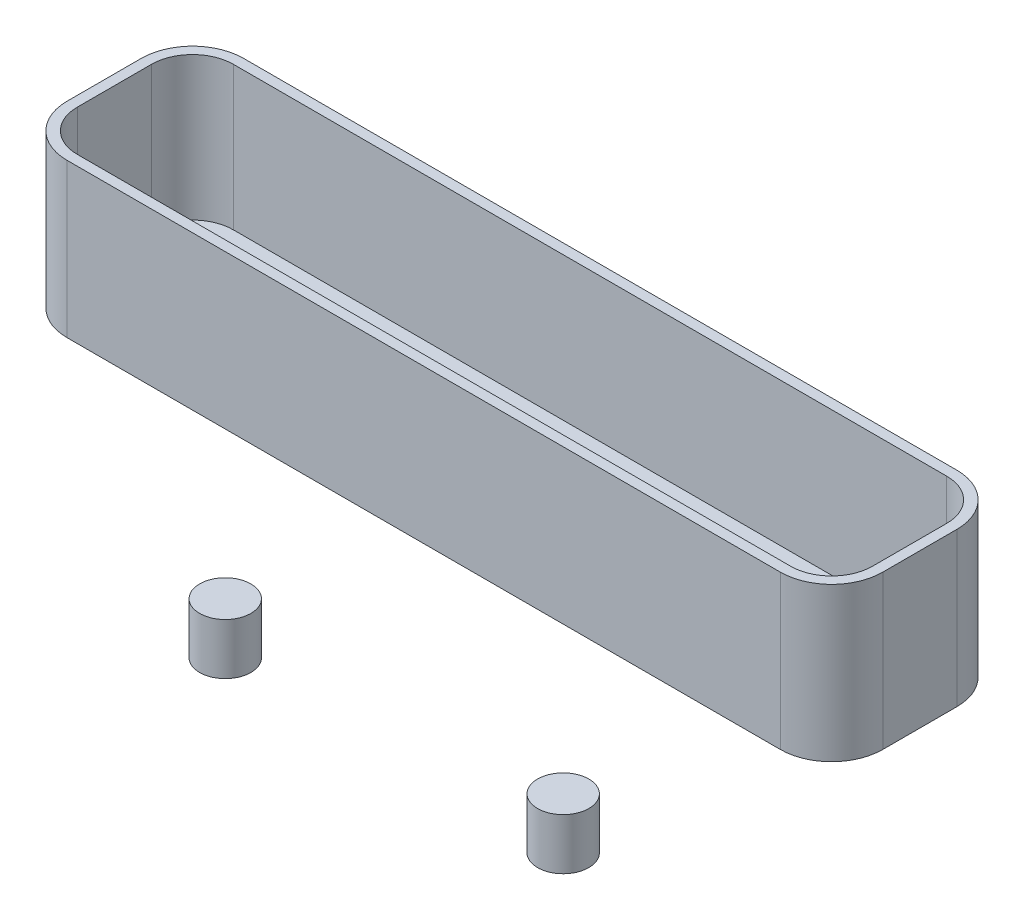
ISO-10303-21;
HEADER;
FILE_DESCRIPTION(('STEP AP214'),'2;1');
FILE_NAME('part.step','',(''),(''),'','','');
FILE_SCHEMA(('AUTOMOTIVE_DESIGN { 1 0 10303 214 1 1 1 1 }'));
ENDSEC;
DATA;
#1=APPLICATION_CONTEXT('core data for automotive mechanical design processes');
#2=APPLICATION_PROTOCOL_DEFINITION('international standard','automotive_design',2000,#1);
#3=PRODUCT_CONTEXT('',#1,'mechanical');
#4=PRODUCT('Part','Part','',(#3));
#5=PRODUCT_RELATED_PRODUCT_CATEGORY('part','',(#4));
#6=PRODUCT_DEFINITION_FORMATION('','',#4);
#7=PRODUCT_DEFINITION_CONTEXT('part definition',#1,'design');
#8=PRODUCT_DEFINITION('design','',#6,#7);
#9=PRODUCT_DEFINITION_SHAPE('','',#8);
#10=(LENGTH_UNIT() NAMED_UNIT(*) SI_UNIT(.MILLI.,.METRE.));
#11=(NAMED_UNIT(*) PLANE_ANGLE_UNIT() SI_UNIT($,.RADIAN.));
#12=(NAMED_UNIT(*) SI_UNIT($,.STERADIAN.) SOLID_ANGLE_UNIT());
#13=UNCERTAINTY_MEASURE_WITH_UNIT(LENGTH_MEASURE(1.E-05),#10,'distance_accuracy_value','');
#14=(GEOMETRIC_REPRESENTATION_CONTEXT(3) GLOBAL_UNCERTAINTY_ASSIGNED_CONTEXT((#13)) GLOBAL_UNIT_ASSIGNED_CONTEXT((#10,
#11,#12)) REPRESENTATION_CONTEXT('',''));
#15=CARTESIAN_POINT('',(0.,0.,0.));
#16=DIRECTION('',(0.,0.,1.));
#17=DIRECTION('',(1.,0.,0.));
#18=AXIS2_PLACEMENT_3D('',#15,#16,#17);
#19=CARTESIAN_POINT('',(79.6511661041203,52.9291308994879,-17.2408657024059));
#20=DIRECTION('',(-1.,0.,0.));
#21=DIRECTION('',(0.,0.,1.));
#22=AXIS2_PLACEMENT_3D('',#19,#20,#21);
#23=PLANE('',#22);
#24=DIRECTION('',(0.,0.,-1.));
#25=VECTOR('',#24,1.);
#26=CARTESIAN_POINT('',(79.6511661041203,52.9291308994879,-17.2408657024059));
#27=LINE('',#26,#25);
#28=CARTESIAN_POINT('',(79.6511661041203,52.9291308994879,7.24086570240593));
#29=VERTEX_POINT('',#28);
#30=CARTESIAN_POINT('',(79.6511661041203,52.9291308994879,-7.24086570240593));
#31=VERTEX_POINT('',#30);
#32=EDGE_CURVE('E211',#29,#31,#27,.T.);
#33=ORIENTED_EDGE('',*,*,#32,.F.);
#34=DIRECTION('',(0.,-1.,0.));
#35=VECTOR('',#34,1.);
#36=CARTESIAN_POINT('',(79.6511661041203,52.9291308994879,7.24086570240593));
#37=LINE('',#36,#35);
#38=CARTESIAN_POINT('',(79.6511661041203,22.9291308994879,7.24086570240593));
#39=VERTEX_POINT('',#38);
#40=EDGE_CURVE('E12',#29,#39,#37,.T.);
#41=ORIENTED_EDGE('',*,*,#40,.T.);
#42=DIRECTION('',(0.,0.,-1.));
#43=VECTOR('',#42,1.);
#44=CARTESIAN_POINT('',(79.6511661041203,22.9291308994879,-17.2408657024059));
#45=LINE('',#44,#43);
#46=CARTESIAN_POINT('',(79.6511661041203,22.9291308994879,-7.24086570240593));
#47=VERTEX_POINT('',#46);
#48=EDGE_CURVE('E224',#39,#47,#45,.T.);
#49=ORIENTED_EDGE('',*,*,#48,.T.);
#50=DIRECTION('',(0.,-1.,0.));
#51=VECTOR('',#50,1.);
#52=CARTESIAN_POINT('',(79.6511661041203,52.9291308994879,-7.24086570240593));
#53=LINE('',#52,#51);
#54=EDGE_CURVE('E50',#47,#31,#53,.F.);
#55=ORIENTED_EDGE('',*,*,#54,.T.);
#56=EDGE_LOOP('',(#33,#41,#49,#55));
#57=FACE_BOUND('',#56,.T.);
#58=ADVANCED_FACE('F42',(#57),#23,.F.);
#59=CARTESIAN_POINT('',(-79.6511661041203,52.9291308994879,-17.2408657024059));
#60=DIRECTION('',(0.,0.,1.));
#61=DIRECTION('',(1.,0.,0.));
#62=AXIS2_PLACEMENT_3D('',#59,#60,#61);
#63=PLANE('',#62);
#64=DIRECTION('',(-1.,0.,0.));
#65=VECTOR('',#64,1.);
#66=CARTESIAN_POINT('',(-79.6511661041203,22.9291308994879,-17.2408657024059));
#67=LINE('',#66,#65);
#68=CARTESIAN_POINT('',(69.6511661041203,22.9291308994879,-17.2408657024059));
#69=VERTEX_POINT('',#68);
#70=CARTESIAN_POINT('',(-69.6511661041203,22.9291308994879,-17.2408657024059));
#71=VERTEX_POINT('',#70);
#72=EDGE_CURVE('E227',#69,#71,#67,.T.);
#73=ORIENTED_EDGE('',*,*,#72,.T.);
#74=DIRECTION('',(0.,-1.,0.));
#75=VECTOR('',#74,1.);
#76=CARTESIAN_POINT('',(-69.6511661041203,52.9291308994879,-17.2408657024059));
#77=LINE('',#76,#75);
#78=CARTESIAN_POINT('',(-69.6511661041203,52.9291308994879,-17.2408657024059));
#79=VERTEX_POINT('',#78);
#80=EDGE_CURVE('E65',#71,#79,#77,.F.);
#81=ORIENTED_EDGE('',*,*,#80,.T.);
#82=DIRECTION('',(-1.,0.,0.));
#83=VECTOR('',#82,1.);
#84=CARTESIAN_POINT('',(-79.6511661041203,52.9291308994879,-17.2408657024059));
#85=LINE('',#84,#83);
#86=CARTESIAN_POINT('',(69.6511661041203,52.9291308994879,-17.2408657024059));
#87=VERTEX_POINT('',#86);
#88=EDGE_CURVE('E214',#87,#79,#85,.T.);
#89=ORIENTED_EDGE('',*,*,#88,.F.);
#90=DIRECTION('',(0.,-1.,0.));
#91=VECTOR('',#90,1.);
#92=CARTESIAN_POINT('',(69.6511661041203,52.9291308994879,-17.2408657024059));
#93=LINE('',#92,#91);
#94=EDGE_CURVE('E260',#87,#69,#93,.T.);
#95=ORIENTED_EDGE('',*,*,#94,.T.);
#96=EDGE_LOOP('',(#73,#81,#89,#95));
#97=FACE_BOUND('',#96,.T.);
#98=ADVANCED_FACE('F275',(#97),#63,.F.);
#99=CARTESIAN_POINT('',(-79.6511661041203,52.9291308994879,-17.2408657024059));
#100=DIRECTION('',(1.,0.,0.));
#101=DIRECTION('',(0.,0.,-1.));
#102=AXIS2_PLACEMENT_3D('',#99,#100,#101);
#103=PLANE('',#102);
#104=DIRECTION('',(0.,0.,1.));
#105=VECTOR('',#104,1.);
#106=CARTESIAN_POINT('',(-79.6511661041203,22.9291308994879,-17.2408657024059));
#107=LINE('',#106,#105);
#108=CARTESIAN_POINT('',(-79.6511661041203,22.9291308994879,-7.24086570240593));
#109=VERTEX_POINT('',#108);
#110=CARTESIAN_POINT('',(-79.6511661041203,22.9291308994879,7.24086570240593));
#111=VERTEX_POINT('',#110);
#112=EDGE_CURVE('E230',#109,#111,#107,.T.);
#113=ORIENTED_EDGE('',*,*,#112,.T.);
#114=DIRECTION('',(0.,-1.,0.));
#115=VECTOR('',#114,1.);
#116=CARTESIAN_POINT('',(-79.6511661041203,52.9291308994879,7.24086570240593));
#117=LINE('',#116,#115);
#118=CARTESIAN_POINT('',(-79.6511661041203,52.9291308994879,7.24086570240593));
#119=VERTEX_POINT('',#118);
#120=EDGE_CURVE('E250',#111,#119,#117,.F.);
#121=ORIENTED_EDGE('',*,*,#120,.T.);
#122=DIRECTION('',(0.,0.,1.));
#123=VECTOR('',#122,1.);
#124=CARTESIAN_POINT('',(-79.6511661041203,52.9291308994879,-17.2408657024059));
#125=LINE('',#124,#123);
#126=CARTESIAN_POINT('',(-79.6511661041203,52.9291308994879,-7.24086570240593));
#127=VERTEX_POINT('',#126);
#128=EDGE_CURVE('E217',#127,#119,#125,.T.);
#129=ORIENTED_EDGE('',*,*,#128,.F.);
#130=DIRECTION('',(0.,-1.,0.));
#131=VECTOR('',#130,1.);
#132=CARTESIAN_POINT('',(-79.6511661041203,52.9291308994879,-7.24086570240593));
#133=LINE('',#132,#131);
#134=EDGE_CURVE('E247',#127,#109,#133,.T.);
#135=ORIENTED_EDGE('',*,*,#134,.T.);
#136=EDGE_LOOP('',(#113,#121,#129,#135));
#137=FACE_BOUND('',#136,.T.);
#138=ADVANCED_FACE('F286',(#137),#103,.F.);
#139=CARTESIAN_POINT('',(-79.6511661041203,52.9291308994879,17.2408657024059));
#140=DIRECTION('',(0.,0.,-1.));
#141=DIRECTION('',(-1.,0.,0.));
#142=AXIS2_PLACEMENT_3D('',#139,#140,#141);
#143=PLANE('',#142);
#144=DIRECTION('',(1.,0.,0.));
#145=VECTOR('',#144,1.);
#146=CARTESIAN_POINT('',(-79.6511661041203,52.9291308994879,17.2408657024059));
#147=LINE('',#146,#145);
#148=CARTESIAN_POINT('',(-69.6511661041203,52.9291308994879,17.2408657024059));
#149=VERTEX_POINT('',#148);
#150=CARTESIAN_POINT('',(69.6511661041203,52.9291308994879,17.2408657024059));
#151=VERTEX_POINT('',#150);
#152=EDGE_CURVE('E220',#149,#151,#147,.T.);
#153=ORIENTED_EDGE('',*,*,#152,.F.);
#154=DIRECTION('',(0.,-1.,0.));
#155=VECTOR('',#154,1.);
#156=CARTESIAN_POINT('',(-69.6511661041203,52.9291308994879,17.2408657024059));
#157=LINE('',#156,#155);
#158=CARTESIAN_POINT('',(-69.6511661041203,22.9291308994879,17.2408657024059));
#159=VERTEX_POINT('',#158);
#160=EDGE_CURVE('E236',#149,#159,#157,.T.);
#161=ORIENTED_EDGE('',*,*,#160,.T.);
#162=DIRECTION('',(1.,0.,0.));
#163=VECTOR('',#162,1.);
#164=CARTESIAN_POINT('',(-79.6511661041203,22.9291308994879,17.2408657024059));
#165=LINE('',#164,#163);
#166=CARTESIAN_POINT('',(69.6511661041203,22.9291308994879,17.2408657024059));
#167=VERTEX_POINT('',#166);
#168=EDGE_CURVE('E215',#159,#167,#165,.T.);
#169=ORIENTED_EDGE('',*,*,#168,.T.);
#170=DIRECTION('',(0.,-1.,0.));
#171=VECTOR('',#170,1.);
#172=CARTESIAN_POINT('',(69.6511661041203,52.9291308994879,17.2408657024059));
#173=LINE('',#172,#171);
#174=EDGE_CURVE('E223',#167,#151,#173,.F.);
#175=ORIENTED_EDGE('',*,*,#174,.T.);
#176=EDGE_LOOP('',(#153,#161,#169,#175));
#177=FACE_BOUND('',#176,.T.);
#178=ADVANCED_FACE('F294',(#177),#143,.F.);
#179=CARTESIAN_POINT('',(0.,52.9291308994879,0.));
#180=DIRECTION('',(0.,1.,0.));
#181=DIRECTION('',(0.,0.,1.));
#182=AXIS2_PLACEMENT_3D('',#179,#180,#181);
#183=PLANE('',#182);
#184=DIRECTION('',(0.,0.,1.));
#185=VECTOR('',#184,1.);
#186=CARTESIAN_POINT('',(-77.6511661041203,52.9291308994879,-17.2408657024059));
#187=LINE('',#186,#185);
#188=CARTESIAN_POINT('',(-77.6511661041203,52.9291308994879,-7.24086570240593));
#189=VERTEX_POINT('',#188);
#190=CARTESIAN_POINT('',(-77.6511661041203,52.9291308994879,7.24086570240593));
#191=VERTEX_POINT('',#190);
#192=EDGE_CURVE('E184',#189,#191,#187,.T.);
#193=ORIENTED_EDGE('',*,*,#192,.F.);
#194=CARTESIAN_POINT('',(-69.6511661041203,52.9291308994879,-7.24086570240593));
#195=DIRECTION('',(0.,1.,0.));
#196=DIRECTION('',(0.,0.,1.));
#197=AXIS2_PLACEMENT_3D('',#194,#195,#196);
#198=CIRCLE('',#197,8.);
#199=CARTESIAN_POINT('',(-69.6511661041203,52.9291308994879,-15.2408657024059));
#200=VERTEX_POINT('',#199);
#201=EDGE_CURVE('E202',#200,#189,#198,.T.);
#202=ORIENTED_EDGE('',*,*,#201,.F.);
#203=DIRECTION('',(-1.,0.,0.));
#204=VECTOR('',#203,1.);
#205=CARTESIAN_POINT('',(-79.6511661041203,52.9291308994879,-15.2408657024059));
#206=LINE('',#205,#204);
#207=CARTESIAN_POINT('',(69.6511661041203,52.9291308994879,-15.2408657024059));
#208=VERTEX_POINT('',#207);
#209=EDGE_CURVE('E57',#208,#200,#206,.T.);
#210=ORIENTED_EDGE('',*,*,#209,.F.);
#211=CARTESIAN_POINT('',(69.6511661041203,52.9291308994879,-7.24086570240593));
#212=DIRECTION('',(0.,1.,0.));
#213=DIRECTION('',(0.,0.,1.));
#214=AXIS2_PLACEMENT_3D('',#211,#212,#213);
#215=CIRCLE('',#214,8.);
#216=CARTESIAN_POINT('',(77.6511661041203,52.9291308994879,-7.24086570240593));
#217=VERTEX_POINT('',#216);
#218=EDGE_CURVE('E186',#217,#208,#215,.T.);
#219=ORIENTED_EDGE('',*,*,#218,.F.);
#220=DIRECTION('',(0.,0.,-1.));
#221=VECTOR('',#220,1.);
#222=CARTESIAN_POINT('',(77.6511661041203,52.9291308994879,-17.2408657024059));
#223=LINE('',#222,#221);
#224=CARTESIAN_POINT('',(77.6511661041203,52.9291308994879,7.24086570240593));
#225=VERTEX_POINT('',#224);
#226=EDGE_CURVE('E198',#225,#217,#223,.T.);
#227=ORIENTED_EDGE('',*,*,#226,.F.);
#228=CARTESIAN_POINT('',(69.6511661041203,52.9291308994879,7.24086570240593));
#229=DIRECTION('',(0.,1.,0.));
#230=DIRECTION('',(0.,0.,1.));
#231=AXIS2_PLACEMENT_3D('',#228,#229,#230);
#232=CIRCLE('',#231,8.);
#233=CARTESIAN_POINT('',(69.6511661041203,52.9291308994879,15.2408657024059));
#234=VERTEX_POINT('',#233);
#235=EDGE_CURVE('E188',#234,#225,#232,.T.);
#236=ORIENTED_EDGE('',*,*,#235,.F.);
#237=DIRECTION('',(1.,0.,0.));
#238=VECTOR('',#237,1.);
#239=CARTESIAN_POINT('',(-79.6511661041203,52.9291308994879,15.2408657024059));
#240=LINE('',#239,#238);
#241=CARTESIAN_POINT('',(-69.6511661041203,52.9291308994879,15.2408657024059));
#242=VERTEX_POINT('',#241);
#243=EDGE_CURVE('E197',#242,#234,#240,.T.);
#244=ORIENTED_EDGE('',*,*,#243,.F.);
#245=CARTESIAN_POINT('',(-69.6511661041203,52.9291308994879,7.24086570240593));
#246=DIRECTION('',(0.,1.,0.));
#247=DIRECTION('',(0.,0.,1.));
#248=AXIS2_PLACEMENT_3D('',#245,#246,#247);
#249=CIRCLE('',#248,8.);
#250=EDGE_CURVE('E204',#191,#242,#249,.T.);
#251=ORIENTED_EDGE('',*,*,#250,.F.);
#252=EDGE_LOOP('',(#193,#202,#210,#219,#227,#236,#244,#251));
#253=FACE_BOUND('',#252,.T.);
#254=ORIENTED_EDGE('',*,*,#128,.T.);
#255=CARTESIAN_POINT('',(-69.6511661041203,52.9291308994879,7.24086570240593));
#256=DIRECTION('',(0.,1.,0.));
#257=DIRECTION('',(0.,0.,1.));
#258=AXIS2_PLACEMENT_3D('',#255,#256,#257);
#259=CIRCLE('',#258,10.);
#260=EDGE_CURVE('E258',#119,#149,#259,.T.);
#261=ORIENTED_EDGE('',*,*,#260,.T.);
#262=ORIENTED_EDGE('',*,*,#152,.T.);
#263=CARTESIAN_POINT('',(69.6511661041203,52.9291308994879,7.24086570240593));
#264=DIRECTION('',(0.,1.,0.));
#265=DIRECTION('',(0.,0.,1.));
#266=AXIS2_PLACEMENT_3D('',#263,#264,#265);
#267=CIRCLE('',#266,10.);
#268=EDGE_CURVE('E254',#151,#29,#267,.T.);
#269=ORIENTED_EDGE('',*,*,#268,.T.);
#270=ORIENTED_EDGE('',*,*,#32,.T.);
#271=CARTESIAN_POINT('',(69.6511661041203,52.9291308994879,-7.24086570240593));
#272=DIRECTION('',(0.,1.,0.));
#273=DIRECTION('',(0.,0.,1.));
#274=AXIS2_PLACEMENT_3D('',#271,#272,#273);
#275=CIRCLE('',#274,10.);
#276=EDGE_CURVE('E252',#31,#87,#275,.T.);
#277=ORIENTED_EDGE('',*,*,#276,.T.);
#278=ORIENTED_EDGE('',*,*,#88,.T.);
#279=CARTESIAN_POINT('',(-69.6511661041203,52.9291308994879,-7.24086570240593));
#280=DIRECTION('',(0.,1.,0.));
#281=DIRECTION('',(0.,0.,1.));
#282=AXIS2_PLACEMENT_3D('',#279,#280,#281);
#283=CIRCLE('',#282,10.);
#284=EDGE_CURVE('E256',#79,#127,#283,.T.);
#285=ORIENTED_EDGE('',*,*,#284,.T.);
#286=EDGE_LOOP('',(#254,#261,#262,#269,#270,#277,#278,#285));
#287=FACE_BOUND('',#286,.T.);
#288=ADVANCED_FACE('F271',(#253,#287),#183,.T.);
#289=CARTESIAN_POINT('',(0.,22.9291308994879,0.));
#290=DIRECTION('',(0.,1.,0.));
#291=DIRECTION('',(0.,0.,1.));
#292=AXIS2_PLACEMENT_3D('',#289,#290,#291);
#293=PLANE('',#292);
#294=ORIENTED_EDGE('',*,*,#168,.F.);
#295=CARTESIAN_POINT('',(-69.6511661041203,22.9291308994879,7.24086570240593));
#296=DIRECTION('',(0.,1.,0.));
#297=DIRECTION('',(0.,0.,1.));
#298=AXIS2_PLACEMENT_3D('',#295,#296,#297);
#299=CIRCLE('',#298,10.);
#300=EDGE_CURVE('E245',#159,#111,#299,.F.);
#301=ORIENTED_EDGE('',*,*,#300,.T.);
#302=ORIENTED_EDGE('',*,*,#112,.F.);
#303=CARTESIAN_POINT('',(-69.6511661041203,22.9291308994879,-7.24086570240593));
#304=DIRECTION('',(0.,1.,0.));
#305=DIRECTION('',(0.,0.,1.));
#306=AXIS2_PLACEMENT_3D('',#303,#304,#305);
#307=CIRCLE('',#306,10.);
#308=EDGE_CURVE('E243',#109,#71,#307,.F.);
#309=ORIENTED_EDGE('',*,*,#308,.T.);
#310=ORIENTED_EDGE('',*,*,#72,.F.);
#311=CARTESIAN_POINT('',(69.6511661041203,22.9291308994879,-7.24086570240593));
#312=DIRECTION('',(0.,1.,0.));
#313=DIRECTION('',(0.,0.,1.));
#314=AXIS2_PLACEMENT_3D('',#311,#312,#313);
#315=CIRCLE('',#314,10.);
#316=EDGE_CURVE('E239',#69,#47,#315,.F.);
#317=ORIENTED_EDGE('',*,*,#316,.T.);
#318=ORIENTED_EDGE('',*,*,#48,.F.);
#319=CARTESIAN_POINT('',(69.6511661041203,22.9291308994879,7.24086570240593));
#320=DIRECTION('',(0.,1.,0.));
#321=DIRECTION('',(0.,0.,1.));
#322=AXIS2_PLACEMENT_3D('',#319,#320,#321);
#323=CIRCLE('',#322,10.);
#324=EDGE_CURVE('E241',#39,#167,#323,.F.);
#325=ORIENTED_EDGE('',*,*,#324,.T.);
#326=EDGE_LOOP('',(#294,#301,#302,#309,#310,#317,#318,#325));
#327=FACE_BOUND('',#326,.T.);
#328=ADVANCED_FACE('F278',(#327),#293,.F.);
#329=CARTESIAN_POINT('',(-69.6511661041203,52.9291308994879,7.24086570240593));
#330=DIRECTION('',(0.,-1.,0.));
#331=DIRECTION('',(0.,0.,-1.));
#332=AXIS2_PLACEMENT_3D('',#329,#330,#331);
#333=CYLINDRICAL_SURFACE('',#332,10.);
#334=ORIENTED_EDGE('',*,*,#260,.F.);
#335=ORIENTED_EDGE('',*,*,#120,.F.);
#336=ORIENTED_EDGE('',*,*,#300,.F.);
#337=ORIENTED_EDGE('',*,*,#160,.F.);
#338=EDGE_LOOP('',(#334,#335,#336,#337));
#339=FACE_BOUND('',#338,.T.);
#340=ADVANCED_FACE('F292',(#339),#333,.T.);
#341=CARTESIAN_POINT('',(-69.6511661041203,52.9291308994879,-7.24086570240593));
#342=DIRECTION('',(0.,-1.,0.));
#343=DIRECTION('',(0.,0.,-1.));
#344=AXIS2_PLACEMENT_3D('',#341,#342,#343);
#345=CYLINDRICAL_SURFACE('',#344,10.);
#346=ORIENTED_EDGE('',*,*,#284,.F.);
#347=ORIENTED_EDGE('',*,*,#80,.F.);
#348=ORIENTED_EDGE('',*,*,#308,.F.);
#349=ORIENTED_EDGE('',*,*,#134,.F.);
#350=EDGE_LOOP('',(#346,#347,#348,#349));
#351=FACE_BOUND('',#350,.T.);
#352=ADVANCED_FACE('F283',(#351),#345,.T.);
#353=CARTESIAN_POINT('',(69.6511661041203,52.9291308994879,7.24086570240593));
#354=DIRECTION('',(0.,-1.,0.));
#355=DIRECTION('',(0.,0.,-1.));
#356=AXIS2_PLACEMENT_3D('',#353,#354,#355);
#357=CYLINDRICAL_SURFACE('',#356,10.);
#358=ORIENTED_EDGE('',*,*,#268,.F.);
#359=ORIENTED_EDGE('',*,*,#174,.F.);
#360=ORIENTED_EDGE('',*,*,#324,.F.);
#361=ORIENTED_EDGE('',*,*,#40,.F.);
#362=EDGE_LOOP('',(#358,#359,#360,#361));
#363=FACE_BOUND('',#362,.T.);
#364=ADVANCED_FACE('F297',(#363),#357,.T.);
#365=CARTESIAN_POINT('',(69.6511661041203,52.9291308994879,-7.24086570240593));
#366=DIRECTION('',(0.,-1.,0.));
#367=DIRECTION('',(0.,0.,-1.));
#368=AXIS2_PLACEMENT_3D('',#365,#366,#367);
#369=CYLINDRICAL_SURFACE('',#368,10.);
#370=ORIENTED_EDGE('',*,*,#276,.F.);
#371=ORIENTED_EDGE('',*,*,#54,.F.);
#372=ORIENTED_EDGE('',*,*,#316,.F.);
#373=ORIENTED_EDGE('',*,*,#94,.F.);
#374=EDGE_LOOP('',(#370,#371,#372,#373));
#375=FACE_BOUND('',#374,.T.);
#376=ADVANCED_FACE('F44',(#375),#369,.T.);
#377=CARTESIAN_POINT('',(77.6511661041203,52.9291308994879,-17.2408657024059));
#378=DIRECTION('',(-1.,0.,0.));
#379=DIRECTION('',(0.,0.,1.));
#380=AXIS2_PLACEMENT_3D('',#377,#378,#379);
#381=PLANE('',#380);
#382=ORIENTED_EDGE('',*,*,#226,.T.);
#383=DIRECTION('',(0.,1.,0.));
#384=VECTOR('',#383,1.);
#385=CARTESIAN_POINT('',(77.6511661041203,52.9291308994879,-7.24086570240593));
#386=LINE('',#385,#384);
#387=CARTESIAN_POINT('',(77.6511661041203,24.9291308994879,-7.24086570240593));
#388=VERTEX_POINT('',#387);
#389=EDGE_CURVE('E432',#388,#217,#386,.T.);
#390=ORIENTED_EDGE('',*,*,#389,.F.);
#391=DIRECTION('',(0.,0.,-1.));
#392=VECTOR('',#391,1.);
#393=CARTESIAN_POINT('',(77.6511661041203,24.9291308994879,-17.2408657024059));
#394=LINE('',#393,#392);
#395=CARTESIAN_POINT('',(77.6511661041203,24.9291308994879,7.24086570240593));
#396=VERTEX_POINT('',#395);
#397=EDGE_CURVE('E443',#396,#388,#394,.T.);
#398=ORIENTED_EDGE('',*,*,#397,.F.);
#399=DIRECTION('',(0.,1.,0.));
#400=VECTOR('',#399,1.);
#401=CARTESIAN_POINT('',(77.6511661041203,52.9291308994879,7.24086570240593));
#402=LINE('',#401,#400);
#403=EDGE_CURVE('E228',#225,#396,#402,.F.);
#404=ORIENTED_EDGE('',*,*,#403,.F.);
#405=EDGE_LOOP('',(#382,#390,#398,#404));
#406=FACE_BOUND('',#405,.T.);
#407=ADVANCED_FACE('F303',(#406),#381,.T.);
#408=CARTESIAN_POINT('',(-79.6511661041203,52.9291308994879,-15.2408657024059));
#409=DIRECTION('',(0.,0.,1.));
#410=DIRECTION('',(1.,0.,0.));
#411=AXIS2_PLACEMENT_3D('',#408,#409,#410);
#412=PLANE('',#411);
#413=DIRECTION('',(-1.,0.,0.));
#414=VECTOR('',#413,1.);
#415=CARTESIAN_POINT('',(-79.6511661041203,24.9291308994879,-15.2408657024059));
#416=LINE('',#415,#414);
#417=CARTESIAN_POINT('',(69.6511661041203,24.9291308994879,-15.2408657024059));
#418=VERTEX_POINT('',#417);
#419=CARTESIAN_POINT('',(-69.6511661041203,24.9291308994879,-15.2408657024059));
#420=VERTEX_POINT('',#419);
#421=EDGE_CURVE('E180',#418,#420,#416,.T.);
#422=ORIENTED_EDGE('',*,*,#421,.F.);
#423=DIRECTION('',(0.,1.,0.));
#424=VECTOR('',#423,1.);
#425=CARTESIAN_POINT('',(69.6511661041203,52.9291308994879,-15.2408657024059));
#426=LINE('',#425,#424);
#427=EDGE_CURVE('E207',#208,#418,#426,.F.);
#428=ORIENTED_EDGE('',*,*,#427,.F.);
#429=ORIENTED_EDGE('',*,*,#209,.T.);
#430=DIRECTION('',(0.,1.,0.));
#431=VECTOR('',#430,1.);
#432=CARTESIAN_POINT('',(-69.6511661041203,52.9291308994879,-15.2408657024059));
#433=LINE('',#432,#431);
#434=EDGE_CURVE('E434',#420,#200,#433,.T.);
#435=ORIENTED_EDGE('',*,*,#434,.F.);
#436=EDGE_LOOP('',(#422,#428,#429,#435));
#437=FACE_BOUND('',#436,.T.);
#438=ADVANCED_FACE('F352',(#437),#412,.T.);
#439=CARTESIAN_POINT('',(-77.6511661041203,52.9291308994879,-17.2408657024059));
#440=DIRECTION('',(1.,0.,0.));
#441=DIRECTION('',(0.,0.,-1.));
#442=AXIS2_PLACEMENT_3D('',#439,#440,#441);
#443=PLANE('',#442);
#444=DIRECTION('',(0.,0.,1.));
#445=VECTOR('',#444,1.);
#446=CARTESIAN_POINT('',(-77.6511661041203,24.9291308994879,-17.2408657024059));
#447=LINE('',#446,#445);
#448=CARTESIAN_POINT('',(-77.6511661041203,24.9291308994879,-7.24086570240593));
#449=VERTEX_POINT('',#448);
#450=CARTESIAN_POINT('',(-77.6511661041203,24.9291308994879,7.24086570240593));
#451=VERTEX_POINT('',#450);
#452=EDGE_CURVE('E173',#449,#451,#447,.T.);
#453=ORIENTED_EDGE('',*,*,#452,.F.);
#454=DIRECTION('',(0.,1.,0.));
#455=VECTOR('',#454,1.);
#456=CARTESIAN_POINT('',(-77.6511661041203,52.9291308994879,-7.24086570240593));
#457=LINE('',#456,#455);
#458=EDGE_CURVE('E169',#189,#449,#457,.F.);
#459=ORIENTED_EDGE('',*,*,#458,.F.);
#460=ORIENTED_EDGE('',*,*,#192,.T.);
#461=DIRECTION('',(0.,1.,0.));
#462=VECTOR('',#461,1.);
#463=CARTESIAN_POINT('',(-77.6511661041203,52.9291308994879,7.24086570240593));
#464=LINE('',#463,#462);
#465=EDGE_CURVE('E162',#451,#191,#464,.T.);
#466=ORIENTED_EDGE('',*,*,#465,.F.);
#467=EDGE_LOOP('',(#453,#459,#460,#466));
#468=FACE_BOUND('',#467,.T.);
#469=ADVANCED_FACE('F182',(#468),#443,.T.);
#470=CARTESIAN_POINT('',(-79.6511661041203,52.9291308994879,15.2408657024059));
#471=DIRECTION('',(0.,0.,-1.));
#472=DIRECTION('',(-1.,0.,0.));
#473=AXIS2_PLACEMENT_3D('',#470,#471,#472);
#474=PLANE('',#473);
#475=ORIENTED_EDGE('',*,*,#243,.T.);
#476=DIRECTION('',(0.,1.,0.));
#477=VECTOR('',#476,1.);
#478=CARTESIAN_POINT('',(69.6511661041203,52.9291308994879,15.2408657024059));
#479=LINE('',#478,#477);
#480=CARTESIAN_POINT('',(69.6511661041203,24.9291308994879,15.2408657024059));
#481=VERTEX_POINT('',#480);
#482=EDGE_CURVE('E195',#481,#234,#479,.T.);
#483=ORIENTED_EDGE('',*,*,#482,.F.);
#484=DIRECTION('',(1.,0.,0.));
#485=VECTOR('',#484,1.);
#486=CARTESIAN_POINT('',(-79.6511661041203,24.9291308994879,15.2408657024059));
#487=LINE('',#486,#485);
#488=CARTESIAN_POINT('',(-69.6511661041203,24.9291308994879,15.2408657024059));
#489=VERTEX_POINT('',#488);
#490=EDGE_CURVE('E179',#489,#481,#487,.T.);
#491=ORIENTED_EDGE('',*,*,#490,.F.);
#492=DIRECTION('',(0.,1.,0.));
#493=VECTOR('',#492,1.);
#494=CARTESIAN_POINT('',(-69.6511661041203,52.9291308994879,15.2408657024059));
#495=LINE('',#494,#493);
#496=EDGE_CURVE('E165',#242,#489,#495,.F.);
#497=ORIENTED_EDGE('',*,*,#496,.F.);
#498=EDGE_LOOP('',(#475,#483,#491,#497));
#499=FACE_BOUND('',#498,.T.);
#500=ADVANCED_FACE('F370',(#499),#474,.T.);
#501=CARTESIAN_POINT('',(0.,24.9291308994879,0.));
#502=DIRECTION('',(0.,1.,0.));
#503=DIRECTION('',(0.,0.,1.));
#504=AXIS2_PLACEMENT_3D('',#501,#502,#503);
#505=PLANE('',#504);
#506=ORIENTED_EDGE('',*,*,#490,.T.);
#507=CARTESIAN_POINT('',(69.6511661041203,24.9291308994879,7.24086570240593));
#508=DIRECTION('',(0.,1.,0.));
#509=DIRECTION('',(0.,0.,1.));
#510=AXIS2_PLACEMENT_3D('',#507,#508,#509);
#511=CIRCLE('',#510,8.);
#512=EDGE_CURVE('E439',#396,#481,#511,.F.);
#513=ORIENTED_EDGE('',*,*,#512,.F.);
#514=ORIENTED_EDGE('',*,*,#397,.T.);
#515=CARTESIAN_POINT('',(69.6511661041203,24.9291308994879,-7.24086570240593));
#516=DIRECTION('',(0.,1.,0.));
#517=DIRECTION('',(0.,0.,1.));
#518=AXIS2_PLACEMENT_3D('',#515,#516,#517);
#519=CIRCLE('',#518,8.);
#520=EDGE_CURVE('E194',#418,#388,#519,.F.);
#521=ORIENTED_EDGE('',*,*,#520,.F.);
#522=ORIENTED_EDGE('',*,*,#421,.T.);
#523=CARTESIAN_POINT('',(-69.6511661041203,24.9291308994879,-7.24086570240593));
#524=DIRECTION('',(0.,1.,0.));
#525=DIRECTION('',(0.,0.,1.));
#526=AXIS2_PLACEMENT_3D('',#523,#524,#525);
#527=CIRCLE('',#526,8.);
#528=EDGE_CURVE('E170',#449,#420,#527,.F.);
#529=ORIENTED_EDGE('',*,*,#528,.F.);
#530=ORIENTED_EDGE('',*,*,#452,.T.);
#531=CARTESIAN_POINT('',(-69.6511661041203,24.9291308994879,7.24086570240593));
#532=DIRECTION('',(0.,1.,0.));
#533=DIRECTION('',(0.,0.,1.));
#534=AXIS2_PLACEMENT_3D('',#531,#532,#533);
#535=CIRCLE('',#534,8.);
#536=EDGE_CURVE('E158',#489,#451,#535,.F.);
#537=ORIENTED_EDGE('',*,*,#536,.F.);
#538=EDGE_LOOP('',(#506,#513,#514,#521,#522,#529,#530,#537));
#539=FACE_BOUND('',#538,.T.);
#540=ADVANCED_FACE('F174',(#539),#505,.T.);
#541=CARTESIAN_POINT('',(-69.6511661041203,52.9291308994879,7.24086570240593));
#542=DIRECTION('',(0.,-1.,0.));
#543=DIRECTION('',(0.,0.,-1.));
#544=AXIS2_PLACEMENT_3D('',#541,#542,#543);
#545=CYLINDRICAL_SURFACE('',#544,8.);
#546=ORIENTED_EDGE('',*,*,#250,.T.);
#547=ORIENTED_EDGE('',*,*,#496,.T.);
#548=ORIENTED_EDGE('',*,*,#536,.T.);
#549=ORIENTED_EDGE('',*,*,#465,.T.);
#550=EDGE_LOOP('',(#546,#547,#548,#549));
#551=FACE_BOUND('',#550,.T.);
#552=ADVANCED_FACE('F160',(#551),#545,.F.);
#553=CARTESIAN_POINT('',(-69.6511661041203,52.9291308994879,-7.24086570240593));
#554=DIRECTION('',(0.,-1.,0.));
#555=DIRECTION('',(0.,0.,-1.));
#556=AXIS2_PLACEMENT_3D('',#553,#554,#555);
#557=CYLINDRICAL_SURFACE('',#556,8.);
#558=ORIENTED_EDGE('',*,*,#201,.T.);
#559=ORIENTED_EDGE('',*,*,#458,.T.);
#560=ORIENTED_EDGE('',*,*,#528,.T.);
#561=ORIENTED_EDGE('',*,*,#434,.T.);
#562=EDGE_LOOP('',(#558,#559,#560,#561));
#563=FACE_BOUND('',#562,.T.);
#564=ADVANCED_FACE('F396',(#563),#557,.F.);
#565=CARTESIAN_POINT('',(69.6511661041203,52.9291308994879,7.24086570240593));
#566=DIRECTION('',(0.,-1.,0.));
#567=DIRECTION('',(0.,0.,-1.));
#568=AXIS2_PLACEMENT_3D('',#565,#566,#567);
#569=CYLINDRICAL_SURFACE('',#568,8.);
#570=ORIENTED_EDGE('',*,*,#235,.T.);
#571=ORIENTED_EDGE('',*,*,#403,.T.);
#572=ORIENTED_EDGE('',*,*,#512,.T.);
#573=ORIENTED_EDGE('',*,*,#482,.T.);
#574=EDGE_LOOP('',(#570,#571,#572,#573));
#575=FACE_BOUND('',#574,.T.);
#576=ADVANCED_FACE('F405',(#575),#569,.F.);
#577=CARTESIAN_POINT('',(69.6511661041203,52.9291308994879,-7.24086570240593));
#578=DIRECTION('',(0.,-1.,0.));
#579=DIRECTION('',(0.,0.,-1.));
#580=AXIS2_PLACEMENT_3D('',#577,#578,#579);
#581=CYLINDRICAL_SURFACE('',#580,8.);
#582=ORIENTED_EDGE('',*,*,#218,.T.);
#583=ORIENTED_EDGE('',*,*,#427,.T.);
#584=ORIENTED_EDGE('',*,*,#520,.T.);
#585=ORIENTED_EDGE('',*,*,#389,.T.);
#586=EDGE_LOOP('',(#582,#583,#584,#585));
#587=FACE_BOUND('',#586,.T.);
#588=ADVANCED_FACE('F415',(#587),#581,.F.);
#589=CLOSED_SHELL('',(#58,#98,#138,#178,#288,#328,#340,#352,#364,#376,#407,#438,#469,#500,#540,
#552,#564,#576,#588));
#590=MANIFOLD_SOLID_BREP('B2',#589);
#591=CARTESIAN_POINT('',(33.,-10.,-23.2267107304856));
#592=DIRECTION('',(0.,1.,0.));
#593=DIRECTION('',(0.,0.,1.));
#594=AXIS2_PLACEMENT_3D('',#591,#592,#593);
#595=CYLINDRICAL_SURFACE('',#594,5.);
#596=CARTESIAN_POINT('',(33.,-10.,-23.2267107304856));
#597=DIRECTION('',(0.,-1.,0.));
#598=DIRECTION('',(0.,0.,-1.));
#599=AXIS2_PLACEMENT_3D('',#596,#597,#598);
#600=CIRCLE('',#599,5.);
#601=CARTESIAN_POINT('',(33.,-10.,-28.2267107304856));
#602=VERTEX_POINT('',#601);
#603=EDGE_CURVE('E41',#602,#602,#600,.T.);
#604=ORIENTED_EDGE('',*,*,#603,.F.);
#605=EDGE_LOOP('',(#604));
#606=FACE_BOUND('',#605,.T.);
#607=CARTESIAN_POINT('',(33.,0.,-23.2267107304856));
#608=DIRECTION('',(0.,-1.,0.));
#609=DIRECTION('',(0.,0.,-1.));
#610=AXIS2_PLACEMENT_3D('',#607,#608,#609);
#611=CIRCLE('',#610,5.);
#612=CARTESIAN_POINT('',(33.,0.,-28.2267107304856));
#613=VERTEX_POINT('',#612);
#614=EDGE_CURVE('E500',#613,#613,#611,.T.);
#615=ORIENTED_EDGE('',*,*,#614,.T.);
#616=EDGE_LOOP('',(#615));
#617=FACE_BOUND('',#616,.T.);
#618=ADVANCED_FACE('F497',(#606,#617),#595,.T.);
#619=CARTESIAN_POINT('',(33.,-10.,-23.2267107304856));
#620=DIRECTION('',(0.,-1.,0.));
#621=DIRECTION('',(0.,0.,-1.));
#622=AXIS2_PLACEMENT_3D('',#619,#620,#621);
#623=PLANE('',#622);
#624=ORIENTED_EDGE('',*,*,#603,.T.);
#625=EDGE_LOOP('',(#624));
#626=FACE_BOUND('',#625,.T.);
#627=ADVANCED_FACE('F512',(#626),#623,.T.);
#628=CARTESIAN_POINT('',(33.,0.,-23.2267107304856));
#629=DIRECTION('',(0.,-1.,0.));
#630=DIRECTION('',(0.,0.,-1.));
#631=AXIS2_PLACEMENT_3D('',#628,#629,#630);
#632=PLANE('',#631);
#633=ORIENTED_EDGE('',*,*,#614,.F.);
#634=EDGE_LOOP('',(#633));
#635=FACE_BOUND('',#634,.T.);
#636=ADVANCED_FACE('F510',(#635),#632,.F.);
#637=CLOSED_SHELL('',(#618,#627,#636));
#638=MANIFOLD_SOLID_BREP('B6',#637);
#639=CARTESIAN_POINT('',(-33.,-10.,-23.));
#640=DIRECTION('',(0.,1.,0.));
#641=DIRECTION('',(0.,0.,1.));
#642=AXIS2_PLACEMENT_3D('',#639,#640,#641);
#643=CYLINDRICAL_SURFACE('',#642,5.);
#644=CARTESIAN_POINT('',(-33.,-10.,-23.));
#645=DIRECTION('',(0.,-1.,0.));
#646=DIRECTION('',(0.,0.,-1.));
#647=AXIS2_PLACEMENT_3D('',#644,#645,#646);
#648=CIRCLE('',#647,5.);
#649=CARTESIAN_POINT('',(-33.,-10.,-28.));
#650=VERTEX_POINT('',#649);
#651=EDGE_CURVE('E496',#650,#650,#648,.T.);
#652=ORIENTED_EDGE('',*,*,#651,.F.);
#653=EDGE_LOOP('',(#652));
#654=FACE_BOUND('',#653,.T.);
#655=CARTESIAN_POINT('',(-33.,0.,-23.));
#656=DIRECTION('',(0.,-1.,0.));
#657=DIRECTION('',(0.,0.,-1.));
#658=AXIS2_PLACEMENT_3D('',#655,#656,#657);
#659=CIRCLE('',#658,5.);
#660=CARTESIAN_POINT('',(-33.,0.,-28.));
#661=VERTEX_POINT('',#660);
#662=EDGE_CURVE('E549',#661,#661,#659,.T.);
#663=ORIENTED_EDGE('',*,*,#662,.T.);
#664=EDGE_LOOP('',(#663));
#665=FACE_BOUND('',#664,.T.);
#666=ADVANCED_FACE('F546',(#654,#665),#643,.T.);
#667=CARTESIAN_POINT('',(-33.,-10.,-23.));
#668=DIRECTION('',(0.,-1.,0.));
#669=DIRECTION('',(0.,0.,-1.));
#670=AXIS2_PLACEMENT_3D('',#667,#668,#669);
#671=PLANE('',#670);
#672=ORIENTED_EDGE('',*,*,#651,.T.);
#673=EDGE_LOOP('',(#672));
#674=FACE_BOUND('',#673,.T.);
#675=ADVANCED_FACE('F561',(#674),#671,.T.);
#676=CARTESIAN_POINT('',(-33.,0.,-23.));
#677=DIRECTION('',(0.,-1.,0.));
#678=DIRECTION('',(0.,0.,-1.));
#679=AXIS2_PLACEMENT_3D('',#676,#677,#678);
#680=PLANE('',#679);
#681=ORIENTED_EDGE('',*,*,#662,.F.);
#682=EDGE_LOOP('',(#681));
#683=FACE_BOUND('',#682,.T.);
#684=ADVANCED_FACE('F559',(#683),#680,.F.);
#685=CLOSED_SHELL('',(#666,#675,#684));
#686=MANIFOLD_SOLID_BREP('B36',#685);
#687=CARTESIAN_POINT('',(33.,-10.,23.));
#688=DIRECTION('',(0.,1.,0.));
#689=DIRECTION('',(0.,0.,1.));
#690=AXIS2_PLACEMENT_3D('',#687,#688,#689);
#691=CYLINDRICAL_SURFACE('',#690,5.);
#692=CARTESIAN_POINT('',(33.,-10.,23.));
#693=DIRECTION('',(0.,-1.,0.));
#694=DIRECTION('',(0.,0.,-1.));
#695=AXIS2_PLACEMENT_3D('',#692,#693,#694);
#696=CIRCLE('',#695,5.);
#697=CARTESIAN_POINT('',(33.,-10.,18.));
#698=VERTEX_POINT('',#697);
#699=EDGE_CURVE('E545',#698,#698,#696,.T.);
#700=ORIENTED_EDGE('',*,*,#699,.F.);
#701=EDGE_LOOP('',(#700));
#702=FACE_BOUND('',#701,.T.);
#703=CARTESIAN_POINT('',(33.,0.,23.));
#704=DIRECTION('',(0.,-1.,0.));
#705=DIRECTION('',(0.,0.,-1.));
#706=AXIS2_PLACEMENT_3D('',#703,#704,#705);
#707=CIRCLE('',#706,5.);
#708=CARTESIAN_POINT('',(33.,0.,18.));
#709=VERTEX_POINT('',#708);
#710=EDGE_CURVE('E597',#709,#709,#707,.T.);
#711=ORIENTED_EDGE('',*,*,#710,.T.);
#712=EDGE_LOOP('',(#711));
#713=FACE_BOUND('',#712,.T.);
#714=ADVANCED_FACE('F594',(#702,#713),#691,.T.);
#715=CARTESIAN_POINT('',(33.,-10.,23.));
#716=DIRECTION('',(0.,-1.,0.));
#717=DIRECTION('',(0.,0.,-1.));
#718=AXIS2_PLACEMENT_3D('',#715,#716,#717);
#719=PLANE('',#718);
#720=ORIENTED_EDGE('',*,*,#699,.T.);
#721=EDGE_LOOP('',(#720));
#722=FACE_BOUND('',#721,.T.);
#723=ADVANCED_FACE('F609',(#722),#719,.T.);
#724=CARTESIAN_POINT('',(33.,0.,23.));
#725=DIRECTION('',(0.,-1.,0.));
#726=DIRECTION('',(0.,0.,-1.));
#727=AXIS2_PLACEMENT_3D('',#724,#725,#726);
#728=PLANE('',#727);
#729=ORIENTED_EDGE('',*,*,#710,.F.);
#730=EDGE_LOOP('',(#729));
#731=FACE_BOUND('',#730,.T.);
#732=ADVANCED_FACE('F607',(#731),#728,.F.);
#733=CLOSED_SHELL('',(#714,#723,#732));
#734=MANIFOLD_SOLID_BREP('B491',#733);
#735=CARTESIAN_POINT('',(-33.,-10.,23.));
#736=DIRECTION('',(0.,1.,0.));
#737=DIRECTION('',(0.,0.,1.));
#738=AXIS2_PLACEMENT_3D('',#735,#736,#737);
#739=CYLINDRICAL_SURFACE('',#738,5.);
#740=CARTESIAN_POINT('',(-33.,-10.,23.));
#741=DIRECTION('',(0.,-1.,0.));
#742=DIRECTION('',(0.,0.,-1.));
#743=AXIS2_PLACEMENT_3D('',#740,#741,#742);
#744=CIRCLE('',#743,5.);
#745=CARTESIAN_POINT('',(-33.,-10.,18.));
#746=VERTEX_POINT('',#745);
#747=EDGE_CURVE('E593',#746,#746,#744,.T.);
#748=ORIENTED_EDGE('',*,*,#747,.F.);
#749=EDGE_LOOP('',(#748));
#750=FACE_BOUND('',#749,.T.);
#751=CARTESIAN_POINT('',(-33.,0.,23.));
#752=DIRECTION('',(0.,-1.,0.));
#753=DIRECTION('',(0.,0.,-1.));
#754=AXIS2_PLACEMENT_3D('',#751,#752,#753);
#755=CIRCLE('',#754,5.);
#756=CARTESIAN_POINT('',(-33.,0.,18.));
#757=VERTEX_POINT('',#756);
#758=EDGE_CURVE('E638',#757,#757,#755,.T.);
#759=ORIENTED_EDGE('',*,*,#758,.T.);
#760=EDGE_LOOP('',(#759));
#761=FACE_BOUND('',#760,.T.);
#762=ADVANCED_FACE('F635',(#750,#761),#739,.T.);
#763=CARTESIAN_POINT('',(-33.,-10.,23.));
#764=DIRECTION('',(0.,-1.,0.));
#765=DIRECTION('',(0.,0.,-1.));
#766=AXIS2_PLACEMENT_3D('',#763,#764,#765);
#767=PLANE('',#766);
#768=ORIENTED_EDGE('',*,*,#747,.T.);
#769=EDGE_LOOP('',(#768));
#770=FACE_BOUND('',#769,.T.);
#771=ADVANCED_FACE('F650',(#770),#767,.T.);
#772=CARTESIAN_POINT('',(-33.,0.,23.));
#773=DIRECTION('',(0.,-1.,0.));
#774=DIRECTION('',(0.,0.,-1.));
#775=AXIS2_PLACEMENT_3D('',#772,#773,#774);
#776=PLANE('',#775);
#777=ORIENTED_EDGE('',*,*,#758,.F.);
#778=EDGE_LOOP('',(#777));
#779=FACE_BOUND('',#778,.T.);
#780=ADVANCED_FACE('F648',(#779),#776,.F.);
#781=CLOSED_SHELL('',(#762,#771,#780));
#782=MANIFOLD_SOLID_BREP('B540',#781);
#783=ADVANCED_BREP_SHAPE_REPRESENTATION('',(#18,#590,#638,#686,#734,#782),#14);
#784=SHAPE_DEFINITION_REPRESENTATION(#9,#783);
ENDSEC;
END-ISO-10303-21;
